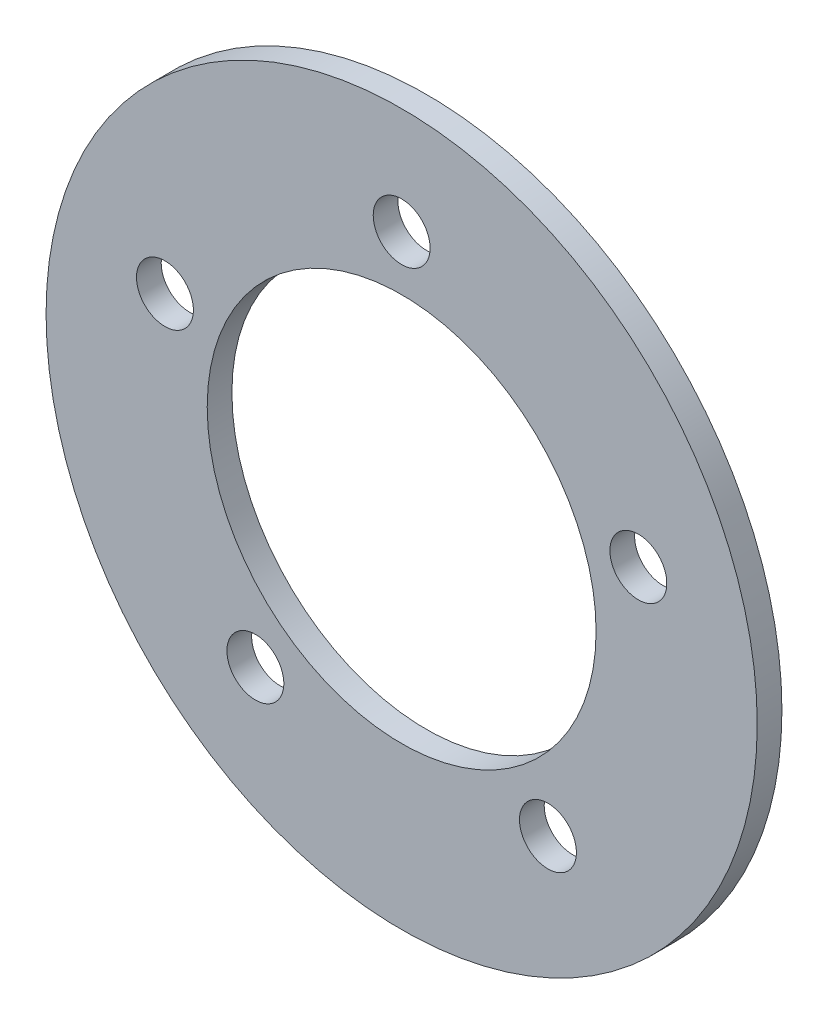
ISO-10303-21;
HEADER;
FILE_DESCRIPTION(('STEP AP214'),'2;1');
FILE_NAME('part.step','',(''),(''),'','','');
FILE_SCHEMA(('AUTOMOTIVE_DESIGN { 1 0 10303 214 1 1 1 1 }'));
ENDSEC;
DATA;
#1=APPLICATION_CONTEXT('core data for automotive mechanical design processes');
#2=APPLICATION_PROTOCOL_DEFINITION('international standard','automotive_design',2000,#1);
#3=PRODUCT_CONTEXT('',#1,'mechanical');
#4=PRODUCT('Part','Part','',(#3));
#5=PRODUCT_RELATED_PRODUCT_CATEGORY('part','',(#4));
#6=PRODUCT_DEFINITION_FORMATION('','',#4);
#7=PRODUCT_DEFINITION_CONTEXT('part definition',#1,'design');
#8=PRODUCT_DEFINITION('design','',#6,#7);
#9=PRODUCT_DEFINITION_SHAPE('','',#8);
#10=(LENGTH_UNIT() NAMED_UNIT(*) SI_UNIT(.MILLI.,.METRE.));
#11=(NAMED_UNIT(*) PLANE_ANGLE_UNIT() SI_UNIT($,.RADIAN.));
#12=(NAMED_UNIT(*) SI_UNIT($,.STERADIAN.) SOLID_ANGLE_UNIT());
#13=UNCERTAINTY_MEASURE_WITH_UNIT(LENGTH_MEASURE(1.E-05),#10,'distance_accuracy_value','');
#14=(GEOMETRIC_REPRESENTATION_CONTEXT(3) GLOBAL_UNCERTAINTY_ASSIGNED_CONTEXT((#13)) GLOBAL_UNIT_ASSIGNED_CONTEXT((#10,
#11,#12)) REPRESENTATION_CONTEXT('',''));
#15=CARTESIAN_POINT('',(0.,0.,0.));
#16=DIRECTION('',(0.,0.,1.));
#17=DIRECTION('',(1.,0.,0.));
#18=AXIS2_PLACEMENT_3D('',#15,#16,#17);
#19=CARTESIAN_POINT('',(0.,0.,-14.2875));
#20=DIRECTION('',(0.,0.,-1.));
#21=DIRECTION('',(-1.,0.,0.));
#22=AXIS2_PLACEMENT_3D('',#19,#20,#21);
#23=PLANE('',#22);
#24=CARTESIAN_POINT('',(15.2169042607224,4.94427190999933,-14.2875));
#25=DIRECTION('',(0.,0.,-1.));
#26=DIRECTION('',(-1.,0.,0.));
#27=AXIS2_PLACEMENT_3D('',#24,#25,#26);
#28=CIRCLE('',#27,1.8288);
#29=CARTESIAN_POINT('',(13.3881042607224,4.94427190999933,-14.2875));
#30=VERTEX_POINT('',#29);
#31=EDGE_CURVE('E73',#30,#30,#28,.T.);
#32=ORIENTED_EDGE('',*,*,#31,.F.);
#33=EDGE_LOOP('',(#32));
#34=FACE_BOUND('',#33,.T.);
#35=CARTESIAN_POINT('',(-9.4045640366795,-12.9442719099992,-14.2875));
#36=DIRECTION('',(0.,0.,-1.));
#37=DIRECTION('',(-1.,0.,0.));
#38=AXIS2_PLACEMENT_3D('',#35,#36,#37);
#39=CIRCLE('',#38,1.8288);
#40=CARTESIAN_POINT('',(-11.2333640366795,-12.9442719099992,-14.2875));
#41=VERTEX_POINT('',#40);
#42=EDGE_CURVE('E61',#41,#41,#39,.T.);
#43=ORIENTED_EDGE('',*,*,#42,.F.);
#44=EDGE_LOOP('',(#43));
#45=FACE_BOUND('',#44,.T.);
#46=CARTESIAN_POINT('',(0.,0.,-14.2875));
#47=DIRECTION('',(0.,0.,-1.));
#48=DIRECTION('',(-1.,0.,0.));
#49=AXIS2_PLACEMENT_3D('',#46,#47,#48);
#50=CIRCLE('',#49,12.5);
#51=CARTESIAN_POINT('',(-12.5,0.,-14.2875));
#52=VERTEX_POINT('',#51);
#53=EDGE_CURVE('E50',#52,#52,#50,.T.);
#54=ORIENTED_EDGE('',*,*,#53,.F.);
#55=EDGE_LOOP('',(#54));
#56=FACE_BOUND('',#55,.T.);
#57=CARTESIAN_POINT('',(0.,0.,-14.2875));
#58=DIRECTION('',(0.,0.,-1.));
#59=DIRECTION('',(-1.,0.,0.));
#60=AXIS2_PLACEMENT_3D('',#57,#58,#59);
#61=CIRCLE('',#60,22.86);
#62=CARTESIAN_POINT('',(-22.86,0.,-14.2875));
#63=VERTEX_POINT('',#62);
#64=EDGE_CURVE('E10',#63,#63,#61,.T.);
#65=ORIENTED_EDGE('',*,*,#64,.T.);
#66=EDGE_LOOP('',(#65));
#67=FACE_BOUND('',#66,.T.);
#68=CARTESIAN_POINT('',(-15.2169042607225,4.94427190999912,-14.2875));
#69=DIRECTION('',(0.,0.,-1.));
#70=DIRECTION('',(-1.,0.,0.));
#71=AXIS2_PLACEMENT_3D('',#68,#69,#70);
#72=CIRCLE('',#71,1.8288);
#73=CARTESIAN_POINT('',(-17.0457042607225,4.94427190999912,-14.2875));
#74=VERTEX_POINT('',#73);
#75=EDGE_CURVE('E55',#74,#74,#72,.T.);
#76=ORIENTED_EDGE('',*,*,#75,.F.);
#77=EDGE_LOOP('',(#76));
#78=FACE_BOUND('',#77,.T.);
#79=CARTESIAN_POINT('',(9.40456403667968,-12.9442719099991,-14.2875));
#80=DIRECTION('',(0.,0.,-1.));
#81=DIRECTION('',(-1.,0.,0.));
#82=AXIS2_PLACEMENT_3D('',#79,#80,#81);
#83=CIRCLE('',#82,1.8288);
#84=CARTESIAN_POINT('',(7.57576403667969,-12.9442719099991,-14.2875));
#85=VERTEX_POINT('',#84);
#86=EDGE_CURVE('E67',#85,#85,#83,.T.);
#87=ORIENTED_EDGE('',*,*,#86,.F.);
#88=EDGE_LOOP('',(#87));
#89=FACE_BOUND('',#88,.T.);
#90=CARTESIAN_POINT('',(0.,16.,-14.2875));
#91=DIRECTION('',(0.,0.,-1.));
#92=DIRECTION('',(-1.,0.,0.));
#93=AXIS2_PLACEMENT_3D('',#90,#91,#92);
#94=CIRCLE('',#93,1.8288);
#95=CARTESIAN_POINT('',(-1.8288,16.,-14.2875));
#96=VERTEX_POINT('',#95);
#97=EDGE_CURVE('E79',#96,#96,#94,.T.);
#98=ORIENTED_EDGE('',*,*,#97,.F.);
#99=EDGE_LOOP('',(#98));
#100=FACE_BOUND('',#99,.T.);
#101=ADVANCED_FACE('F39',(#34,#45,#56,#67,#78,#89,#100),#23,.T.);
#102=CARTESIAN_POINT('',(0.,0.,-12.7));
#103=DIRECTION('',(0.,0.,-1.));
#104=DIRECTION('',(-1.,0.,0.));
#105=AXIS2_PLACEMENT_3D('',#102,#103,#104);
#106=PLANE('',#105);
#107=CARTESIAN_POINT('',(0.,0.,-12.7));
#108=DIRECTION('',(0.,0.,-1.));
#109=DIRECTION('',(-1.,0.,0.));
#110=AXIS2_PLACEMENT_3D('',#107,#108,#109);
#111=CIRCLE('',#110,22.86);
#112=CARTESIAN_POINT('',(-22.86,0.,-12.7));
#113=VERTEX_POINT('',#112);
#114=EDGE_CURVE('E43',#113,#113,#111,.T.);
#115=ORIENTED_EDGE('',*,*,#114,.F.);
#116=EDGE_LOOP('',(#115));
#117=FACE_BOUND('',#116,.T.);
#118=CARTESIAN_POINT('',(0.,0.,-12.7));
#119=DIRECTION('',(0.,0.,-1.));
#120=DIRECTION('',(-1.,0.,0.));
#121=AXIS2_PLACEMENT_3D('',#118,#119,#120);
#122=CIRCLE('',#121,12.5);
#123=CARTESIAN_POINT('',(-12.5,0.,-12.7));
#124=VERTEX_POINT('',#123);
#125=EDGE_CURVE('E52',#124,#124,#122,.T.);
#126=ORIENTED_EDGE('',*,*,#125,.T.);
#127=EDGE_LOOP('',(#126));
#128=FACE_BOUND('',#127,.T.);
#129=CARTESIAN_POINT('',(-15.2169042607225,4.94427190999912,-12.7));
#130=DIRECTION('',(0.,0.,-1.));
#131=DIRECTION('',(-1.,0.,0.));
#132=AXIS2_PLACEMENT_3D('',#129,#130,#131);
#133=CIRCLE('',#132,1.8288);
#134=CARTESIAN_POINT('',(-17.0457042607225,4.94427190999912,-12.7));
#135=VERTEX_POINT('',#134);
#136=EDGE_CURVE('E58',#135,#135,#133,.T.);
#137=ORIENTED_EDGE('',*,*,#136,.T.);
#138=EDGE_LOOP('',(#137));
#139=FACE_BOUND('',#138,.T.);
#140=CARTESIAN_POINT('',(-9.4045640366795,-12.9442719099992,-12.7));
#141=DIRECTION('',(0.,0.,-1.));
#142=DIRECTION('',(-1.,0.,0.));
#143=AXIS2_PLACEMENT_3D('',#140,#141,#142);
#144=CIRCLE('',#143,1.8288);
#145=CARTESIAN_POINT('',(-11.2333640366795,-12.9442719099992,-12.7));
#146=VERTEX_POINT('',#145);
#147=EDGE_CURVE('E64',#146,#146,#144,.T.);
#148=ORIENTED_EDGE('',*,*,#147,.T.);
#149=EDGE_LOOP('',(#148));
#150=FACE_BOUND('',#149,.T.);
#151=CARTESIAN_POINT('',(9.40456403667968,-12.9442719099991,-12.7));
#152=DIRECTION('',(0.,0.,-1.));
#153=DIRECTION('',(-1.,0.,0.));
#154=AXIS2_PLACEMENT_3D('',#151,#152,#153);
#155=CIRCLE('',#154,1.8288);
#156=CARTESIAN_POINT('',(7.57576403667969,-12.9442719099991,-12.7));
#157=VERTEX_POINT('',#156);
#158=EDGE_CURVE('E70',#157,#157,#155,.T.);
#159=ORIENTED_EDGE('',*,*,#158,.T.);
#160=EDGE_LOOP('',(#159));
#161=FACE_BOUND('',#160,.T.);
#162=CARTESIAN_POINT('',(15.2169042607224,4.94427190999933,-12.7));
#163=DIRECTION('',(0.,0.,-1.));
#164=DIRECTION('',(-1.,0.,0.));
#165=AXIS2_PLACEMENT_3D('',#162,#163,#164);
#166=CIRCLE('',#165,1.8288);
#167=CARTESIAN_POINT('',(13.3881042607224,4.94427190999933,-12.7));
#168=VERTEX_POINT('',#167);
#169=EDGE_CURVE('E76',#168,#168,#166,.T.);
#170=ORIENTED_EDGE('',*,*,#169,.T.);
#171=EDGE_LOOP('',(#170));
#172=FACE_BOUND('',#171,.T.);
#173=CARTESIAN_POINT('',(0.,16.,-12.7));
#174=DIRECTION('',(0.,0.,-1.));
#175=DIRECTION('',(-1.,0.,0.));
#176=AXIS2_PLACEMENT_3D('',#173,#174,#175);
#177=CIRCLE('',#176,1.8288);
#178=CARTESIAN_POINT('',(-1.8288,16.,-12.7));
#179=VERTEX_POINT('',#178);
#180=EDGE_CURVE('E82',#179,#179,#177,.T.);
#181=ORIENTED_EDGE('',*,*,#180,.T.);
#182=EDGE_LOOP('',(#181));
#183=FACE_BOUND('',#182,.T.);
#184=ADVANCED_FACE('F92',(#117,#128,#139,#150,#161,#172,#183),#106,.F.);
#185=CARTESIAN_POINT('',(0.,0.,-14.2875));
#186=DIRECTION('',(0.,0.,1.));
#187=DIRECTION('',(1.,0.,0.));
#188=AXIS2_PLACEMENT_3D('',#185,#186,#187);
#189=CYLINDRICAL_SURFACE('',#188,22.86);
#190=ORIENTED_EDGE('',*,*,#64,.F.);
#191=EDGE_LOOP('',(#190));
#192=FACE_BOUND('',#191,.T.);
#193=ORIENTED_EDGE('',*,*,#114,.T.);
#194=EDGE_LOOP('',(#193));
#195=FACE_BOUND('',#194,.T.);
#196=ADVANCED_FACE('F41',(#192,#195),#189,.T.);
#197=CARTESIAN_POINT('',(0.,0.,-14.2875));
#198=DIRECTION('',(0.,0.,1.));
#199=DIRECTION('',(1.,0.,0.));
#200=AXIS2_PLACEMENT_3D('',#197,#198,#199);
#201=CYLINDRICAL_SURFACE('',#200,12.5);
#202=ORIENTED_EDGE('',*,*,#53,.T.);
#203=EDGE_LOOP('',(#202));
#204=FACE_BOUND('',#203,.T.);
#205=ORIENTED_EDGE('',*,*,#125,.F.);
#206=EDGE_LOOP('',(#205));
#207=FACE_BOUND('',#206,.T.);
#208=ADVANCED_FACE('F102',(#204,#207),#201,.F.);
#209=CARTESIAN_POINT('',(-15.2169042607225,4.94427190999912,-14.2875));
#210=DIRECTION('',(0.,0.,1.));
#211=DIRECTION('',(1.,0.,0.));
#212=AXIS2_PLACEMENT_3D('',#209,#210,#211);
#213=CYLINDRICAL_SURFACE('',#212,1.8288);
#214=ORIENTED_EDGE('',*,*,#75,.T.);
#215=EDGE_LOOP('',(#214));
#216=FACE_BOUND('',#215,.T.);
#217=ORIENTED_EDGE('',*,*,#136,.F.);
#218=EDGE_LOOP('',(#217));
#219=FACE_BOUND('',#218,.T.);
#220=ADVANCED_FACE('F105',(#216,#219),#213,.F.);
#221=CARTESIAN_POINT('',(-9.4045640366795,-12.9442719099992,-14.2875));
#222=DIRECTION('',(0.,0.,1.));
#223=DIRECTION('',(1.,0.,0.));
#224=AXIS2_PLACEMENT_3D('',#221,#222,#223);
#225=CYLINDRICAL_SURFACE('',#224,1.8288);
#226=ORIENTED_EDGE('',*,*,#42,.T.);
#227=EDGE_LOOP('',(#226));
#228=FACE_BOUND('',#227,.T.);
#229=ORIENTED_EDGE('',*,*,#147,.F.);
#230=EDGE_LOOP('',(#229));
#231=FACE_BOUND('',#230,.T.);
#232=ADVANCED_FACE('F109',(#228,#231),#225,.F.);
#233=CARTESIAN_POINT('',(9.40456403667968,-12.9442719099991,-14.2875));
#234=DIRECTION('',(0.,0.,1.));
#235=DIRECTION('',(1.,0.,0.));
#236=AXIS2_PLACEMENT_3D('',#233,#234,#235);
#237=CYLINDRICAL_SURFACE('',#236,1.8288);
#238=ORIENTED_EDGE('',*,*,#86,.T.);
#239=EDGE_LOOP('',(#238));
#240=FACE_BOUND('',#239,.T.);
#241=ORIENTED_EDGE('',*,*,#158,.F.);
#242=EDGE_LOOP('',(#241));
#243=FACE_BOUND('',#242,.T.);
#244=ADVANCED_FACE('F113',(#240,#243),#237,.F.);
#245=CARTESIAN_POINT('',(15.2169042607224,4.94427190999933,-14.2875));
#246=DIRECTION('',(0.,0.,1.));
#247=DIRECTION('',(1.,0.,0.));
#248=AXIS2_PLACEMENT_3D('',#245,#246,#247);
#249=CYLINDRICAL_SURFACE('',#248,1.8288);
#250=ORIENTED_EDGE('',*,*,#31,.T.);
#251=EDGE_LOOP('',(#250));
#252=FACE_BOUND('',#251,.T.);
#253=ORIENTED_EDGE('',*,*,#169,.F.);
#254=EDGE_LOOP('',(#253));
#255=FACE_BOUND('',#254,.T.);
#256=ADVANCED_FACE('F117',(#252,#255),#249,.F.);
#257=CARTESIAN_POINT('',(0.,16.,-14.2875));
#258=DIRECTION('',(0.,0.,1.));
#259=DIRECTION('',(1.,0.,0.));
#260=AXIS2_PLACEMENT_3D('',#257,#258,#259);
#261=CYLINDRICAL_SURFACE('',#260,1.8288);
#262=ORIENTED_EDGE('',*,*,#97,.T.);
#263=EDGE_LOOP('',(#262));
#264=FACE_BOUND('',#263,.T.);
#265=ORIENTED_EDGE('',*,*,#180,.F.);
#266=EDGE_LOOP('',(#265));
#267=FACE_BOUND('',#266,.T.);
#268=ADVANCED_FACE('F88',(#264,#267),#261,.F.);
#269=CLOSED_SHELL('',(#101,#184,#196,#208,#220,#232,#244,#256,#268));
#270=MANIFOLD_SOLID_BREP('B2',#269);
#271=ADVANCED_BREP_SHAPE_REPRESENTATION('',(#18,#270),#14);
#272=SHAPE_DEFINITION_REPRESENTATION(#9,#271);
ENDSEC;
END-ISO-10303-21;
